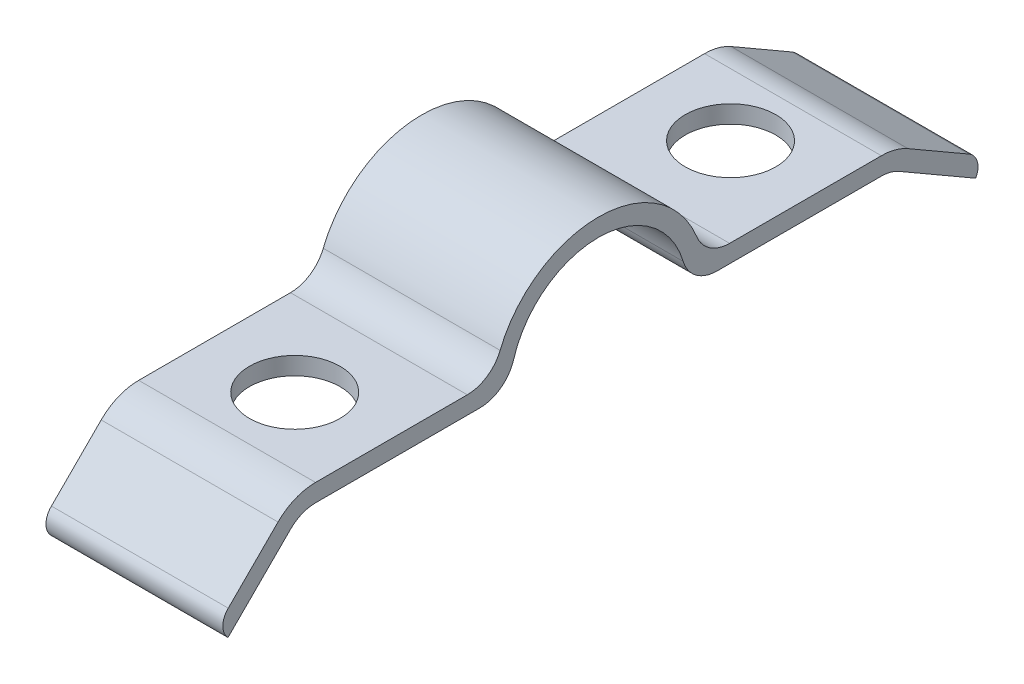
ISO-10303-21;
HEADER;
FILE_DESCRIPTION(('STEP AP214'),'2;1');
FILE_NAME('part.step','',(''),(''),'','','');
FILE_SCHEMA(('AUTOMOTIVE_DESIGN { 1 0 10303 214 1 1 1 1 }'));
ENDSEC;
DATA;
#1=APPLICATION_CONTEXT('core data for automotive mechanical design processes');
#2=APPLICATION_PROTOCOL_DEFINITION('international standard','automotive_design',2000,#1);
#3=PRODUCT_CONTEXT('',#1,'mechanical');
#4=PRODUCT('Part','Part','',(#3));
#5=PRODUCT_RELATED_PRODUCT_CATEGORY('part','',(#4));
#6=PRODUCT_DEFINITION_FORMATION('','',#4);
#7=PRODUCT_DEFINITION_CONTEXT('part definition',#1,'design');
#8=PRODUCT_DEFINITION('design','',#6,#7);
#9=PRODUCT_DEFINITION_SHAPE('','',#8);
#10=(LENGTH_UNIT() NAMED_UNIT(*) SI_UNIT(.MILLI.,.METRE.));
#11=(NAMED_UNIT(*) PLANE_ANGLE_UNIT() SI_UNIT($,.RADIAN.));
#12=(NAMED_UNIT(*) SI_UNIT($,.STERADIAN.) SOLID_ANGLE_UNIT());
#13=UNCERTAINTY_MEASURE_WITH_UNIT(LENGTH_MEASURE(1.E-05),#10,'distance_accuracy_value','');
#14=(GEOMETRIC_REPRESENTATION_CONTEXT(3) GLOBAL_UNCERTAINTY_ASSIGNED_CONTEXT((#13)) GLOBAL_UNIT_ASSIGNED_CONTEXT((#10,
#11,#12)) REPRESENTATION_CONTEXT('',''));
#15=CARTESIAN_POINT('',(0.,0.,0.));
#16=DIRECTION('',(0.,0.,1.));
#17=DIRECTION('',(1.,0.,0.));
#18=AXIS2_PLACEMENT_3D('',#15,#16,#17);
#19=CARTESIAN_POINT('',(3.175,1.27,-4.2597094971371));
#20=DIRECTION('',(-1.,0.,0.));
#21=DIRECTION('',(0.,0.,1.));
#22=AXIS2_PLACEMENT_3D('',#19,#20,#21);
#23=CYLINDRICAL_SURFACE('',#22,1.27);
#24=CARTESIAN_POINT('',(-3.175,1.27,-4.2597094971371));
#25=DIRECTION('',(1.,0.,0.));
#26=DIRECTION('',(0.,0.,1.));
#27=AXIS2_PLACEMENT_3D('',#24,#25,#26);
#28=CIRCLE('',#27,1.27);
#29=CARTESIAN_POINT('',(-3.175,0.907142857142857,-3.04264964081221));
#30=VERTEX_POINT('',#29);
#31=CARTESIAN_POINT('',(-3.175,0.,-4.2597094971371));
#32=VERTEX_POINT('',#31);
#33=EDGE_CURVE('E203',#30,#32,#28,.T.);
#34=ORIENTED_EDGE('',*,*,#33,.T.);
#35=DIRECTION('',(-1.,0.,0.));
#36=VECTOR('',#35,1.);
#37=CARTESIAN_POINT('',(3.175,0.,-4.2597094971371));
#38=LINE('',#37,#36);
#39=CARTESIAN_POINT('',(3.175,0.,-4.2597094971371));
#40=VERTEX_POINT('',#39);
#41=EDGE_CURVE('E11',#40,#32,#38,.T.);
#42=ORIENTED_EDGE('',*,*,#41,.F.);
#43=CARTESIAN_POINT('',(3.175,1.27,-4.2597094971371));
#44=DIRECTION('',(1.,0.,0.));
#45=DIRECTION('',(0.,0.,1.));
#46=AXIS2_PLACEMENT_3D('',#43,#44,#45);
#47=CIRCLE('',#46,1.27);
#48=CARTESIAN_POINT('',(3.175,0.907142857142857,-3.04264964081221));
#49=VERTEX_POINT('',#48);
#50=EDGE_CURVE('E243',#49,#40,#47,.T.);
#51=ORIENTED_EDGE('',*,*,#50,.F.);
#52=DIRECTION('',(-1.,0.,0.));
#53=VECTOR('',#52,1.);
#54=CARTESIAN_POINT('',(3.175,0.907142857142857,-3.04264964081221));
#55=LINE('',#54,#53);
#56=EDGE_CURVE('E199',#49,#30,#55,.T.);
#57=ORIENTED_EDGE('',*,*,#56,.T.);
#58=EDGE_LOOP('',(#34,#42,#51,#57));
#59=FACE_BOUND('',#58,.T.);
#60=ADVANCED_FACE('F34',(#59),#23,.T.);
#61=CARTESIAN_POINT('',(3.175,0.,-4.2597094971371));
#62=DIRECTION('',(0.,1.,0.));
#63=DIRECTION('',(0.,0.,1.));
#64=AXIS2_PLACEMENT_3D('',#61,#62,#63);
#65=PLANE('',#64);
#66=CARTESIAN_POINT('',(0.,0.,-7.91718));
#67=DIRECTION('',(0.,1.,0.));
#68=DIRECTION('',(0.,0.,1.));
#69=AXIS2_PLACEMENT_3D('',#66,#67,#68);
#70=CIRCLE('',#69,1.6256);
#71=CARTESIAN_POINT('',(0.,0.,-6.29158));
#72=VERTEX_POINT('',#71);
#73=EDGE_CURVE('E428',#72,#72,#70,.F.);
#74=ORIENTED_EDGE('',*,*,#73,.F.);
#75=EDGE_LOOP('',(#74));
#76=FACE_BOUND('',#75,.T.);
#77=DIRECTION('',(0.,0.,-1.));
#78=VECTOR('',#77,1.);
#79=CARTESIAN_POINT('',(-3.175,0.,-4.2597094971371));
#80=LINE('',#79,#78);
#81=CARTESIAN_POINT('',(-3.175,0.,-10.16));
#82=VERTEX_POINT('',#81);
#83=EDGE_CURVE('E206',#32,#82,#80,.T.);
#84=ORIENTED_EDGE('',*,*,#83,.T.);
#85=DIRECTION('',(-1.,0.,0.));
#86=VECTOR('',#85,1.);
#87=CARTESIAN_POINT('',(3.175,0.,-10.16));
#88=LINE('',#87,#86);
#89=CARTESIAN_POINT('',(3.175,0.,-10.16));
#90=VERTEX_POINT('',#89);
#91=EDGE_CURVE('E43',#90,#82,#88,.T.);
#92=ORIENTED_EDGE('',*,*,#91,.F.);
#93=DIRECTION('',(0.,0.,-1.));
#94=VECTOR('',#93,1.);
#95=CARTESIAN_POINT('',(3.175,0.,-4.2597094971371));
#96=LINE('',#95,#94);
#97=EDGE_CURVE('E130',#40,#90,#96,.T.);
#98=ORIENTED_EDGE('',*,*,#97,.F.);
#99=ORIENTED_EDGE('',*,*,#41,.T.);
#100=EDGE_LOOP('',(#84,#92,#98,#99));
#101=FACE_BOUND('',#100,.T.);
#102=ADVANCED_FACE('F360',(#76,#101),#65,.F.);
#103=CARTESIAN_POINT('',(3.175,-1.27,-10.16));
#104=DIRECTION('',(-1.,0.,0.));
#105=DIRECTION('',(0.,0.,1.));
#106=AXIS2_PLACEMENT_3D('',#103,#104,#105);
#107=CYLINDRICAL_SURFACE('',#106,1.27);
#108=CARTESIAN_POINT('',(-3.175,-1.27,-10.16));
#109=DIRECTION('',(-1.,0.,0.));
#110=DIRECTION('',(0.,0.,-1.));
#111=AXIS2_PLACEMENT_3D('',#108,#109,#110);
#112=CIRCLE('',#111,1.27);
#113=CARTESIAN_POINT('',(-3.175,-0.170147737193764,-10.795));
#114=VERTEX_POINT('',#113);
#115=EDGE_CURVE('E208',#82,#114,#112,.T.);
#116=ORIENTED_EDGE('',*,*,#115,.T.);
#117=DIRECTION('',(-1.,0.,0.));
#118=VECTOR('',#117,1.);
#119=CARTESIAN_POINT('',(3.175,-0.170147737193764,-10.795));
#120=LINE('',#119,#118);
#121=CARTESIAN_POINT('',(3.175,-0.170147737193764,-10.795));
#122=VERTEX_POINT('',#121);
#123=EDGE_CURVE('E286',#122,#114,#120,.T.);
#124=ORIENTED_EDGE('',*,*,#123,.F.);
#125=CARTESIAN_POINT('',(3.175,-1.27,-10.16));
#126=DIRECTION('',(-1.,0.,0.));
#127=DIRECTION('',(0.,0.,-1.));
#128=AXIS2_PLACEMENT_3D('',#125,#126,#127);
#129=CIRCLE('',#128,1.27);
#130=EDGE_CURVE('E295',#90,#122,#129,.T.);
#131=ORIENTED_EDGE('',*,*,#130,.F.);
#132=ORIENTED_EDGE('',*,*,#91,.T.);
#133=EDGE_LOOP('',(#116,#124,#131,#132));
#134=FACE_BOUND('',#133,.T.);
#135=ADVANCED_FACE('F293',(#134),#107,.F.);
#136=CARTESIAN_POINT('',(3.175,-1.44014773719377,-12.9947045256125));
#137=DIRECTION('',(0.,0.86602540378444,-0.499999999999997));
#138=DIRECTION('',(0.,0.499999999999997,0.86602540378444));
#139=AXIS2_PLACEMENT_3D('',#136,#137,#138);
#140=PLANE('',#139);
#141=DIRECTION('',(0.,-0.499999999999997,-0.86602540378444));
#142=VECTOR('',#141,1.);
#143=CARTESIAN_POINT('',(-3.175,-1.44014773719377,-12.9947045256125));
#144=LINE('',#143,#142);
#145=CARTESIAN_POINT('',(-3.175,-1.75764773719376,-13.5446306570156));
#146=VERTEX_POINT('',#145);
#147=EDGE_CURVE('E211',#114,#146,#144,.T.);
#148=ORIENTED_EDGE('',*,*,#147,.T.);
#149=DIRECTION('',(-1.,0.,0.));
#150=VECTOR('',#149,1.);
#151=CARTESIAN_POINT('',(3.175,-1.75764773719376,-13.5446306570156));
#152=LINE('',#151,#150);
#153=CARTESIAN_POINT('',(3.175,-1.75764773719376,-13.5446306570156));
#154=VERTEX_POINT('',#153);
#155=EDGE_CURVE('E283',#154,#146,#152,.T.);
#156=ORIENTED_EDGE('',*,*,#155,.F.);
#157=DIRECTION('',(0.,-0.500000000000001,-0.866025403784438));
#158=VECTOR('',#157,1.);
#159=CARTESIAN_POINT('',(3.175,-0.170147737193765,-10.795));
#160=LINE('',#159,#158);
#161=EDGE_CURVE('E312',#122,#154,#160,.T.);
#162=ORIENTED_EDGE('',*,*,#161,.F.);
#163=ORIENTED_EDGE('',*,*,#123,.T.);
#164=EDGE_LOOP('',(#148,#156,#162,#163));
#165=FACE_BOUND('',#164,.T.);
#166=ADVANCED_FACE('F303',(#165),#140,.F.);
#167=CARTESIAN_POINT('',(3.175,-1.44014773719377,-12.9947045256125));
#168=DIRECTION('',(-1.,0.,0.));
#169=DIRECTION('',(0.,0.,1.));
#170=AXIS2_PLACEMENT_3D('',#167,#168,#169);
#171=CYLINDRICAL_SURFACE('',#170,0.635000000000001);
#172=CARTESIAN_POINT('',(-3.175,-1.44014773719377,-12.9947045256125));
#173=DIRECTION('',(1.,0.,0.));
#174=DIRECTION('',(0.,0.,-1.));
#175=AXIS2_PLACEMENT_3D('',#172,#173,#174);
#176=CIRCLE('',#175,0.635000000000001);
#177=CARTESIAN_POINT('',(-3.175,-0.890221605790649,-13.3122045256125));
#178=VERTEX_POINT('',#177);
#179=EDGE_CURVE('E213',#146,#178,#176,.T.);
#180=ORIENTED_EDGE('',*,*,#179,.T.);
#181=DIRECTION('',(-1.,0.,0.));
#182=VECTOR('',#181,1.);
#183=CARTESIAN_POINT('',(3.175,-0.890221605790649,-13.3122045256125));
#184=LINE('',#183,#182);
#185=CARTESIAN_POINT('',(3.175,-0.890221605790649,-13.3122045256125));
#186=VERTEX_POINT('',#185);
#187=EDGE_CURVE('E280',#186,#178,#184,.T.);
#188=ORIENTED_EDGE('',*,*,#187,.F.);
#189=CARTESIAN_POINT('',(3.175,-1.44014773719377,-12.9947045256125));
#190=DIRECTION('',(1.,0.,0.));
#191=DIRECTION('',(0.,0.,-1.));
#192=AXIS2_PLACEMENT_3D('',#189,#190,#191);
#193=CIRCLE('',#192,0.635000000000001);
#194=EDGE_CURVE('E309',#154,#186,#193,.T.);
#195=ORIENTED_EDGE('',*,*,#194,.F.);
#196=ORIENTED_EDGE('',*,*,#155,.T.);
#197=EDGE_LOOP('',(#180,#188,#195,#196));
#198=FACE_BOUND('',#197,.T.);
#199=ADVANCED_FACE('F307',(#198),#171,.T.);
#200=CARTESIAN_POINT('',(3.175,0.379778394209357,-11.1125));
#201=DIRECTION('',(0.,-0.866025403784438,0.500000000000001));
#202=DIRECTION('',(0.,-0.500000000000001,-0.866025403784438));
#203=AXIS2_PLACEMENT_3D('',#200,#201,#202);
#204=PLANE('',#203);
#205=DIRECTION('',(0.,0.500000000000001,0.866025403784438));
#206=VECTOR('',#205,1.);
#207=CARTESIAN_POINT('',(-3.175,0.379778394209357,-11.1125));
#208=LINE('',#207,#206);
#209=CARTESIAN_POINT('',(-3.175,0.379778394209357,-11.1125));
#210=VERTEX_POINT('',#209);
#211=EDGE_CURVE('E215',#178,#210,#208,.T.);
#212=ORIENTED_EDGE('',*,*,#211,.T.);
#213=DIRECTION('',(-1.,0.,0.));
#214=VECTOR('',#213,1.);
#215=CARTESIAN_POINT('',(3.175,0.379778394209357,-11.1125));
#216=LINE('',#215,#214);
#217=CARTESIAN_POINT('',(3.175,0.379778394209357,-11.1125));
#218=VERTEX_POINT('',#217);
#219=EDGE_CURVE('E277',#218,#210,#216,.T.);
#220=ORIENTED_EDGE('',*,*,#219,.F.);
#221=DIRECTION('',(0.,0.500000000000001,0.866025403784438));
#222=VECTOR('',#221,1.);
#223=CARTESIAN_POINT('',(3.175,0.379778394209357,-11.1125));
#224=LINE('',#223,#222);
#225=EDGE_CURVE('E311',#186,#218,#224,.T.);
#226=ORIENTED_EDGE('',*,*,#225,.F.);
#227=ORIENTED_EDGE('',*,*,#187,.T.);
#228=EDGE_LOOP('',(#212,#220,#226,#227));
#229=FACE_BOUND('',#228,.T.);
#230=ADVANCED_FACE('F375',(#229),#204,.F.);
#231=CARTESIAN_POINT('',(3.175,-1.27,-10.16));
#232=DIRECTION('',(-1.,0.,0.));
#233=DIRECTION('',(0.,0.,1.));
#234=AXIS2_PLACEMENT_3D('',#231,#232,#233);
#235=CYLINDRICAL_SURFACE('',#234,1.905);
#236=CARTESIAN_POINT('',(-3.175,-1.27,-10.16));
#237=DIRECTION('',(1.,0.,0.));
#238=DIRECTION('',(0.,0.,-1.));
#239=AXIS2_PLACEMENT_3D('',#236,#237,#238);
#240=CIRCLE('',#239,1.905);
#241=CARTESIAN_POINT('',(-3.175,0.635000000000002,-10.16));
#242=VERTEX_POINT('',#241);
#243=EDGE_CURVE('E217',#210,#242,#240,.T.);
#244=ORIENTED_EDGE('',*,*,#243,.T.);
#245=DIRECTION('',(-1.,0.,0.));
#246=VECTOR('',#245,1.);
#247=CARTESIAN_POINT('',(3.175,0.635000000000002,-10.16));
#248=LINE('',#247,#246);
#249=CARTESIAN_POINT('',(3.175,0.635000000000002,-10.16));
#250=VERTEX_POINT('',#249);
#251=EDGE_CURVE('E274',#250,#242,#248,.T.);
#252=ORIENTED_EDGE('',*,*,#251,.F.);
#253=CARTESIAN_POINT('',(3.175,-1.27,-10.16));
#254=DIRECTION('',(1.,0.,0.));
#255=DIRECTION('',(0.,0.,-1.));
#256=AXIS2_PLACEMENT_3D('',#253,#254,#255);
#257=CIRCLE('',#256,1.905);
#258=EDGE_CURVE('E314',#218,#250,#257,.T.);
#259=ORIENTED_EDGE('',*,*,#258,.F.);
#260=ORIENTED_EDGE('',*,*,#219,.T.);
#261=EDGE_LOOP('',(#244,#252,#259,#260));
#262=FACE_BOUND('',#261,.T.);
#263=ADVANCED_FACE('F378',(#262),#235,.T.);
#264=CARTESIAN_POINT('',(3.175,0.635000000000001,-10.16));
#265=DIRECTION('',(0.,-1.,0.));
#266=DIRECTION('',(0.,0.,-1.));
#267=AXIS2_PLACEMENT_3D('',#264,#265,#266);
#268=PLANE('',#267);
#269=CARTESIAN_POINT('',(0.,0.635000000000001,-7.91718));
#270=DIRECTION('',(0.,-1.,0.));
#271=DIRECTION('',(0.,0.,-1.));
#272=AXIS2_PLACEMENT_3D('',#269,#270,#271);
#273=CIRCLE('',#272,1.6256);
#274=CARTESIAN_POINT('',(0.,0.635000000000001,-9.54278));
#275=VERTEX_POINT('',#274);
#276=EDGE_CURVE('E37',#275,#275,#273,.F.);
#277=ORIENTED_EDGE('',*,*,#276,.F.);
#278=EDGE_LOOP('',(#277));
#279=FACE_BOUND('',#278,.T.);
#280=DIRECTION('',(0.,0.,1.));
#281=VECTOR('',#280,1.);
#282=CARTESIAN_POINT('',(-3.175,0.635000000000001,-10.16));
#283=LINE('',#282,#281);
#284=CARTESIAN_POINT('',(-3.175,0.635,-4.70928603930574));
#285=VERTEX_POINT('',#284);
#286=EDGE_CURVE('E219',#242,#285,#283,.T.);
#287=ORIENTED_EDGE('',*,*,#286,.T.);
#288=DIRECTION('',(-1.,0.,0.));
#289=VECTOR('',#288,1.);
#290=CARTESIAN_POINT('',(3.175,0.635,-4.70928603930574));
#291=LINE('',#290,#289);
#292=CARTESIAN_POINT('',(3.175,0.635,-4.70928603930574));
#293=VERTEX_POINT('',#292);
#294=EDGE_CURVE('E271',#293,#285,#291,.T.);
#295=ORIENTED_EDGE('',*,*,#294,.F.);
#296=DIRECTION('',(0.,0.,1.));
#297=VECTOR('',#296,1.);
#298=CARTESIAN_POINT('',(3.175,0.635000000000001,-10.16));
#299=LINE('',#298,#297);
#300=EDGE_CURVE('E320',#250,#293,#299,.T.);
#301=ORIENTED_EDGE('',*,*,#300,.F.);
#302=ORIENTED_EDGE('',*,*,#251,.T.);
#303=EDGE_LOOP('',(#287,#295,#301,#302));
#304=FACE_BOUND('',#303,.T.);
#305=ADVANCED_FACE('F382',(#279,#304),#268,.F.);
#306=CARTESIAN_POINT('',(3.175,1.905,-4.70928603930574));
#307=DIRECTION('',(-1.,0.,0.));
#308=DIRECTION('',(0.,0.,1.));
#309=AXIS2_PLACEMENT_3D('',#306,#307,#308);
#310=CYLINDRICAL_SURFACE('',#309,1.27);
#311=CARTESIAN_POINT('',(-3.175,1.905,-4.70928603930574));
#312=DIRECTION('',(-1.,0.,0.));
#313=DIRECTION('',(0.,0.,1.));
#314=AXIS2_PLACEMENT_3D('',#311,#312,#313);
#315=CIRCLE('',#314,1.27);
#316=CARTESIAN_POINT('',(-3.175,1.42875,-3.53196452947931));
#317=VERTEX_POINT('',#316);
#318=EDGE_CURVE('E221',#285,#317,#315,.T.);
#319=ORIENTED_EDGE('',*,*,#318,.T.);
#320=DIRECTION('',(-1.,0.,0.));
#321=VECTOR('',#320,1.);
#322=CARTESIAN_POINT('',(3.175,1.42875,-3.53196452947931));
#323=LINE('',#322,#321);
#324=CARTESIAN_POINT('',(3.175,1.42875,-3.53196452947931));
#325=VERTEX_POINT('',#324);
#326=EDGE_CURVE('E268',#325,#317,#323,.T.);
#327=ORIENTED_EDGE('',*,*,#326,.F.);
#328=CARTESIAN_POINT('',(3.175,1.905,-4.70928603930574));
#329=DIRECTION('',(-1.,0.,0.));
#330=DIRECTION('',(0.,0.,1.));
#331=AXIS2_PLACEMENT_3D('',#328,#329,#330);
#332=CIRCLE('',#331,1.27);
#333=EDGE_CURVE('E322',#293,#325,#332,.T.);
#334=ORIENTED_EDGE('',*,*,#333,.F.);
#335=ORIENTED_EDGE('',*,*,#294,.T.);
#336=EDGE_LOOP('',(#319,#327,#334,#335));
#337=FACE_BOUND('',#336,.T.);
#338=ADVANCED_FACE('F386',(#337),#310,.F.);
#339=CARTESIAN_POINT('',(3.175,0.,0.));
#340=DIRECTION('',(-1.,0.,0.));
#341=DIRECTION('',(0.,0.,1.));
#342=AXIS2_PLACEMENT_3D('',#339,#340,#341);
#343=CYLINDRICAL_SURFACE('',#342,3.81);
#344=CARTESIAN_POINT('',(-3.175,0.,0.));
#345=DIRECTION('',(1.,0.,0.));
#346=DIRECTION('',(0.,0.,-1.));
#347=AXIS2_PLACEMENT_3D('',#344,#345,#346);
#348=CIRCLE('',#347,3.81);
#349=CARTESIAN_POINT('',(-3.175,1.42875,3.53196452947931));
#350=VERTEX_POINT('',#349);
#351=EDGE_CURVE('E223',#317,#350,#348,.T.);
#352=ORIENTED_EDGE('',*,*,#351,.T.);
#353=DIRECTION('',(-1.,0.,0.));
#354=VECTOR('',#353,1.);
#355=CARTESIAN_POINT('',(3.175,1.42875,3.53196452947931));
#356=LINE('',#355,#354);
#357=CARTESIAN_POINT('',(3.175,1.42875,3.53196452947931));
#358=VERTEX_POINT('',#357);
#359=EDGE_CURVE('E265',#358,#350,#356,.T.);
#360=ORIENTED_EDGE('',*,*,#359,.F.);
#361=CARTESIAN_POINT('',(3.175,0.,0.));
#362=DIRECTION('',(1.,0.,0.));
#363=DIRECTION('',(0.,0.,-1.));
#364=AXIS2_PLACEMENT_3D('',#361,#362,#363);
#365=CIRCLE('',#364,3.81);
#366=EDGE_CURVE('E324',#325,#358,#365,.T.);
#367=ORIENTED_EDGE('',*,*,#366,.F.);
#368=ORIENTED_EDGE('',*,*,#326,.T.);
#369=EDGE_LOOP('',(#352,#360,#367,#368));
#370=FACE_BOUND('',#369,.T.);
#371=ADVANCED_FACE('F390',(#370),#343,.T.);
#372=CARTESIAN_POINT('',(3.175,1.905,4.70928603930574));
#373=DIRECTION('',(-1.,0.,0.));
#374=DIRECTION('',(0.,0.,1.));
#375=AXIS2_PLACEMENT_3D('',#372,#373,#374);
#376=CYLINDRICAL_SURFACE('',#375,1.27);
#377=CARTESIAN_POINT('',(-3.175,1.905,4.70928603930574));
#378=DIRECTION('',(-1.,0.,0.));
#379=DIRECTION('',(0.,0.,-1.));
#380=AXIS2_PLACEMENT_3D('',#377,#378,#379);
#381=CIRCLE('',#380,1.27);
#382=CARTESIAN_POINT('',(-3.175,0.635,4.70928603930574));
#383=VERTEX_POINT('',#382);
#384=EDGE_CURVE('E225',#350,#383,#381,.T.);
#385=ORIENTED_EDGE('',*,*,#384,.T.);
#386=DIRECTION('',(-1.,0.,0.));
#387=VECTOR('',#386,1.);
#388=CARTESIAN_POINT('',(3.175,0.635,4.70928603930574));
#389=LINE('',#388,#387);
#390=CARTESIAN_POINT('',(3.175,0.635,4.70928603930574));
#391=VERTEX_POINT('',#390);
#392=EDGE_CURVE('E262',#391,#383,#389,.T.);
#393=ORIENTED_EDGE('',*,*,#392,.F.);
#394=CARTESIAN_POINT('',(3.175,1.905,4.70928603930574));
#395=DIRECTION('',(-1.,0.,0.));
#396=DIRECTION('',(0.,0.,-1.));
#397=AXIS2_PLACEMENT_3D('',#394,#395,#396);
#398=CIRCLE('',#397,1.27);
#399=EDGE_CURVE('E326',#358,#391,#398,.T.);
#400=ORIENTED_EDGE('',*,*,#399,.F.);
#401=ORIENTED_EDGE('',*,*,#359,.T.);
#402=EDGE_LOOP('',(#385,#393,#400,#401));
#403=FACE_BOUND('',#402,.T.);
#404=ADVANCED_FACE('F394',(#403),#376,.F.);
#405=CARTESIAN_POINT('',(3.175,0.634999999999999,10.16));
#406=DIRECTION('',(0.,-1.,0.));
#407=DIRECTION('',(0.,0.,-1.));
#408=AXIS2_PLACEMENT_3D('',#405,#406,#407);
#409=PLANE('',#408);
#410=CARTESIAN_POINT('',(0.,0.635,7.73176));
#411=DIRECTION('',(0.,-1.,0.));
#412=DIRECTION('',(0.,0.,-1.));
#413=AXIS2_PLACEMENT_3D('',#410,#411,#412);
#414=CIRCLE('',#413,1.6256);
#415=CARTESIAN_POINT('',(0.,0.635,6.10616));
#416=VERTEX_POINT('',#415);
#417=EDGE_CURVE('E427',#416,#416,#414,.F.);
#418=ORIENTED_EDGE('',*,*,#417,.F.);
#419=EDGE_LOOP('',(#418));
#420=FACE_BOUND('',#419,.T.);
#421=DIRECTION('',(0.,0.,1.));
#422=VECTOR('',#421,1.);
#423=CARTESIAN_POINT('',(-3.175,0.634999999999999,10.16));
#424=LINE('',#423,#422);
#425=CARTESIAN_POINT('',(-3.175,0.634999999999999,10.16));
#426=VERTEX_POINT('',#425);
#427=EDGE_CURVE('E227',#383,#426,#424,.T.);
#428=ORIENTED_EDGE('',*,*,#427,.T.);
#429=DIRECTION('',(-1.,0.,0.));
#430=VECTOR('',#429,1.);
#431=CARTESIAN_POINT('',(3.175,0.634999999999999,10.16));
#432=LINE('',#431,#430);
#433=CARTESIAN_POINT('',(3.175,0.634999999999999,10.16));
#434=VERTEX_POINT('',#433);
#435=EDGE_CURVE('E259',#434,#426,#432,.T.);
#436=ORIENTED_EDGE('',*,*,#435,.F.);
#437=DIRECTION('',(0.,0.,1.));
#438=VECTOR('',#437,1.);
#439=CARTESIAN_POINT('',(3.175,0.634999999999999,10.16));
#440=LINE('',#439,#438);
#441=EDGE_CURVE('E328',#391,#434,#440,.T.);
#442=ORIENTED_EDGE('',*,*,#441,.F.);
#443=ORIENTED_EDGE('',*,*,#392,.T.);
#444=EDGE_LOOP('',(#428,#436,#442,#443));
#445=FACE_BOUND('',#444,.T.);
#446=ADVANCED_FACE('F398',(#420,#445),#409,.F.);
#447=CARTESIAN_POINT('',(3.175,-1.27,10.16));
#448=DIRECTION('',(-1.,0.,0.));
#449=DIRECTION('',(0.,0.,1.));
#450=AXIS2_PLACEMENT_3D('',#447,#448,#449);
#451=CYLINDRICAL_SURFACE('',#450,1.905);
#452=CARTESIAN_POINT('',(-3.175,-1.27,10.16));
#453=DIRECTION('',(1.,0.,0.));
#454=DIRECTION('',(0.,0.,-1.));
#455=AXIS2_PLACEMENT_3D('',#452,#453,#454);
#456=CIRCLE('',#455,1.905);
#457=CARTESIAN_POINT('',(-3.175,0.0770384181603793,11.5070384181604));
#458=VERTEX_POINT('',#457);
#459=EDGE_CURVE('E229',#426,#458,#456,.T.);
#460=ORIENTED_EDGE('',*,*,#459,.T.);
#461=DIRECTION('',(-1.,0.,0.));
#462=VECTOR('',#461,1.);
#463=CARTESIAN_POINT('',(3.175,0.0770384181603793,11.5070384181604));
#464=LINE('',#463,#462);
#465=CARTESIAN_POINT('',(3.175,0.0770384181603793,11.5070384181604));
#466=VERTEX_POINT('',#465);
#467=EDGE_CURVE('E256',#466,#458,#464,.T.);
#468=ORIENTED_EDGE('',*,*,#467,.F.);
#469=CARTESIAN_POINT('',(3.175,-1.27,10.16));
#470=DIRECTION('',(1.,0.,0.));
#471=DIRECTION('',(0.,0.,-1.));
#472=AXIS2_PLACEMENT_3D('',#469,#470,#471);
#473=CIRCLE('',#472,1.905);
#474=EDGE_CURVE('E330',#434,#466,#473,.T.);
#475=ORIENTED_EDGE('',*,*,#474,.F.);
#476=ORIENTED_EDGE('',*,*,#435,.T.);
#477=EDGE_LOOP('',(#460,#468,#475,#476));
#478=FACE_BOUND('',#477,.T.);
#479=ADVANCED_FACE('F402',(#478),#451,.T.);
#480=CARTESIAN_POINT('',(3.175,0.0770384181603796,11.5070384181604));
#481=DIRECTION('',(0.,-0.707106781186551,-0.707106781186544));
#482=DIRECTION('',(0.,0.707106781186544,-0.707106781186551));
#483=AXIS2_PLACEMENT_3D('',#480,#481,#482);
#484=PLANE('',#483);
#485=DIRECTION('',(0.,-0.707106781186544,0.707106781186551));
#486=VECTOR('',#485,1.);
#487=CARTESIAN_POINT('',(-3.175,0.0770384181603796,11.5070384181604));
#488=LINE('',#487,#486);
#489=CARTESIAN_POINT('',(-3.175,-1.70885945730652,13.2929362936273));
#490=VERTEX_POINT('',#489);
#491=EDGE_CURVE('E231',#458,#490,#488,.T.);
#492=ORIENTED_EDGE('',*,*,#491,.T.);
#493=DIRECTION('',(-1.,0.,0.));
#494=VECTOR('',#493,1.);
#495=CARTESIAN_POINT('',(3.175,-1.70885945730652,13.2929362936273));
#496=LINE('',#495,#494);
#497=CARTESIAN_POINT('',(3.175,-1.70885945730652,13.2929362936273));
#498=VERTEX_POINT('',#497);
#499=EDGE_CURVE('E253',#498,#490,#496,.T.);
#500=ORIENTED_EDGE('',*,*,#499,.F.);
#501=DIRECTION('',(0.,-0.707106781186544,0.707106781186551));
#502=VECTOR('',#501,1.);
#503=CARTESIAN_POINT('',(3.175,0.0770384181603796,11.5070384181604));
#504=LINE('',#503,#502);
#505=EDGE_CURVE('E332',#466,#498,#504,.T.);
#506=ORIENTED_EDGE('',*,*,#505,.F.);
#507=ORIENTED_EDGE('',*,*,#467,.T.);
#508=EDGE_LOOP('',(#492,#500,#506,#507));
#509=FACE_BOUND('',#508,.T.);
#510=ADVANCED_FACE('F406',(#509),#484,.F.);
#511=CARTESIAN_POINT('',(3.175,-2.1680256121069,12.8540768363208));
#512=DIRECTION('',(-1.,0.,0.));
#513=DIRECTION('',(0.,0.,1.));
#514=AXIS2_PLACEMENT_3D('',#511,#512,#513);
#515=CYLINDRICAL_SURFACE('',#514,0.635162326481627);
#516=CARTESIAN_POINT('',(-3.175,-2.1680256121069,12.8540768363208));
#517=DIRECTION('',(1.,0.,0.));
#518=DIRECTION('',(0.,0.,-1.));
#519=AXIS2_PLACEMENT_3D('',#516,#517,#518);
#520=CIRCLE('',#519,0.635162326481627);
#521=CARTESIAN_POINT('',(-3.175,-2.61715320031628,13.3032044245301));
#522=VERTEX_POINT('',#521);
#523=EDGE_CURVE('E233',#490,#522,#520,.T.);
#524=ORIENTED_EDGE('',*,*,#523,.T.);
#525=DIRECTION('',(-1.,0.,0.));
#526=VECTOR('',#525,1.);
#527=CARTESIAN_POINT('',(3.175,-2.61715320031628,13.3032044245301));
#528=LINE('',#527,#526);
#529=CARTESIAN_POINT('',(3.175,-2.61715320031628,13.3032044245301));
#530=VERTEX_POINT('',#529);
#531=EDGE_CURVE('E250',#530,#522,#528,.T.);
#532=ORIENTED_EDGE('',*,*,#531,.F.);
#533=CARTESIAN_POINT('',(3.175,-2.1680256121069,12.8540768363208));
#534=DIRECTION('',(1.,0.,0.));
#535=DIRECTION('',(0.,0.,-1.));
#536=AXIS2_PLACEMENT_3D('',#533,#534,#535);
#537=CIRCLE('',#536,0.635162326481627);
#538=EDGE_CURVE('E334',#498,#530,#537,.T.);
#539=ORIENTED_EDGE('',*,*,#538,.F.);
#540=ORIENTED_EDGE('',*,*,#499,.T.);
#541=EDGE_LOOP('',(#524,#532,#539,#540));
#542=FACE_BOUND('',#541,.T.);
#543=ADVANCED_FACE('F410',(#542),#515,.T.);
#544=CARTESIAN_POINT('',(3.175,-0.371974387893081,11.0580256121069));
#545=DIRECTION('',(0.,0.707106781186551,0.707106781186544));
#546=DIRECTION('',(0.,-0.707106781186544,0.707106781186551));
#547=AXIS2_PLACEMENT_3D('',#544,#545,#546);
#548=PLANE('',#547);
#549=DIRECTION('',(0.,0.707106781186544,-0.707106781186551));
#550=VECTOR('',#549,1.);
#551=CARTESIAN_POINT('',(-3.175,-0.371974387893081,11.0580256121069));
#552=LINE('',#551,#550);
#553=CARTESIAN_POINT('',(-3.175,-0.371974387893081,11.0580256121069));
#554=VERTEX_POINT('',#553);
#555=EDGE_CURVE('E236',#522,#554,#552,.T.);
#556=ORIENTED_EDGE('',*,*,#555,.T.);
#557=DIRECTION('',(-1.,0.,0.));
#558=VECTOR('',#557,1.);
#559=CARTESIAN_POINT('',(3.175,-0.371974387893081,11.0580256121069));
#560=LINE('',#559,#558);
#561=CARTESIAN_POINT('',(3.175,-0.371974387893081,11.0580256121069));
#562=VERTEX_POINT('',#561);
#563=EDGE_CURVE('E247',#562,#554,#560,.T.);
#564=ORIENTED_EDGE('',*,*,#563,.F.);
#565=DIRECTION('',(0.,0.707106781186544,-0.707106781186551));
#566=VECTOR('',#565,1.);
#567=CARTESIAN_POINT('',(3.175,-2.1680256121069,12.8540768363208));
#568=LINE('',#567,#566);
#569=EDGE_CURVE('E336',#530,#562,#568,.T.);
#570=ORIENTED_EDGE('',*,*,#569,.F.);
#571=ORIENTED_EDGE('',*,*,#531,.T.);
#572=EDGE_LOOP('',(#556,#564,#570,#571));
#573=FACE_BOUND('',#572,.T.);
#574=ADVANCED_FACE('F342',(#573),#548,.F.);
#575=CARTESIAN_POINT('',(3.175,-1.27,10.16));
#576=DIRECTION('',(-1.,0.,0.));
#577=DIRECTION('',(0.,0.,1.));
#578=AXIS2_PLACEMENT_3D('',#575,#576,#577);
#579=CYLINDRICAL_SURFACE('',#578,1.27);
#580=CARTESIAN_POINT('',(-3.175,-1.27,10.16));
#581=DIRECTION('',(-1.,0.,0.));
#582=DIRECTION('',(0.,0.,-1.));
#583=AXIS2_PLACEMENT_3D('',#580,#581,#582);
#584=CIRCLE('',#583,1.27);
#585=CARTESIAN_POINT('',(-3.175,0.,10.16));
#586=VERTEX_POINT('',#585);
#587=EDGE_CURVE('E238',#554,#586,#584,.T.);
#588=ORIENTED_EDGE('',*,*,#587,.T.);
#589=DIRECTION('',(-1.,0.,0.));
#590=VECTOR('',#589,1.);
#591=CARTESIAN_POINT('',(3.175,0.,10.16));
#592=LINE('',#591,#590);
#593=CARTESIAN_POINT('',(3.175,0.,10.16));
#594=VERTEX_POINT('',#593);
#595=EDGE_CURVE('E194',#594,#586,#592,.T.);
#596=ORIENTED_EDGE('',*,*,#595,.F.);
#597=CARTESIAN_POINT('',(3.175,-1.27,10.16));
#598=DIRECTION('',(-1.,0.,0.));
#599=DIRECTION('',(0.,0.,-1.));
#600=AXIS2_PLACEMENT_3D('',#597,#598,#599);
#601=CIRCLE('',#600,1.27);
#602=EDGE_CURVE('E185',#562,#594,#601,.T.);
#603=ORIENTED_EDGE('',*,*,#602,.F.);
#604=ORIENTED_EDGE('',*,*,#563,.T.);
#605=EDGE_LOOP('',(#588,#596,#603,#604));
#606=FACE_BOUND('',#605,.T.);
#607=ADVANCED_FACE('F345',(#606),#579,.F.);
#608=CARTESIAN_POINT('',(3.175,0.,10.16));
#609=DIRECTION('',(0.,1.,0.));
#610=DIRECTION('',(0.,0.,1.));
#611=AXIS2_PLACEMENT_3D('',#608,#609,#610);
#612=PLANE('',#611);
#613=CARTESIAN_POINT('',(0.,0.,7.73176));
#614=DIRECTION('',(0.,1.,0.));
#615=DIRECTION('',(0.,0.,1.));
#616=AXIS2_PLACEMENT_3D('',#613,#614,#615);
#617=CIRCLE('',#616,1.6256);
#618=CARTESIAN_POINT('',(0.,0.,9.35736));
#619=VERTEX_POINT('',#618);
#620=EDGE_CURVE('E425',#619,#619,#617,.F.);
#621=ORIENTED_EDGE('',*,*,#620,.F.);
#622=EDGE_LOOP('',(#621));
#623=FACE_BOUND('',#622,.T.);
#624=DIRECTION('',(0.,0.,-1.));
#625=VECTOR('',#624,1.);
#626=CARTESIAN_POINT('',(-3.175,0.,10.16));
#627=LINE('',#626,#625);
#628=CARTESIAN_POINT('',(-3.175,0.,4.2597094971371));
#629=VERTEX_POINT('',#628);
#630=EDGE_CURVE('E193',#586,#629,#627,.T.);
#631=ORIENTED_EDGE('',*,*,#630,.T.);
#632=DIRECTION('',(-1.,0.,0.));
#633=VECTOR('',#632,1.);
#634=CARTESIAN_POINT('',(3.175,0.,4.2597094971371));
#635=LINE('',#634,#633);
#636=CARTESIAN_POINT('',(3.175,0.,4.2597094971371));
#637=VERTEX_POINT('',#636);
#638=EDGE_CURVE('E190',#637,#629,#635,.T.);
#639=ORIENTED_EDGE('',*,*,#638,.F.);
#640=DIRECTION('',(0.,0.,-1.));
#641=VECTOR('',#640,1.);
#642=CARTESIAN_POINT('',(3.175,0.,10.16));
#643=LINE('',#642,#641);
#644=EDGE_CURVE('E179',#594,#637,#643,.T.);
#645=ORIENTED_EDGE('',*,*,#644,.F.);
#646=ORIENTED_EDGE('',*,*,#595,.T.);
#647=EDGE_LOOP('',(#631,#639,#645,#646));
#648=FACE_BOUND('',#647,.T.);
#649=ADVANCED_FACE('F191',(#623,#648),#612,.F.);
#650=CARTESIAN_POINT('',(3.175,1.27,4.2597094971371));
#651=DIRECTION('',(-1.,0.,0.));
#652=DIRECTION('',(0.,0.,1.));
#653=AXIS2_PLACEMENT_3D('',#650,#651,#652);
#654=CYLINDRICAL_SURFACE('',#653,1.27);
#655=CARTESIAN_POINT('',(-3.175,1.27,4.2597094971371));
#656=DIRECTION('',(1.,0.,0.));
#657=DIRECTION('',(0.,0.,-1.));
#658=AXIS2_PLACEMENT_3D('',#655,#656,#657);
#659=CIRCLE('',#658,1.27);
#660=CARTESIAN_POINT('',(-3.175,0.907142857142856,3.04264964081221));
#661=VERTEX_POINT('',#660);
#662=EDGE_CURVE('E116',#629,#661,#659,.T.);
#663=ORIENTED_EDGE('',*,*,#662,.T.);
#664=DIRECTION('',(-1.,0.,0.));
#665=VECTOR('',#664,1.);
#666=CARTESIAN_POINT('',(3.175,0.907142857142856,3.04264964081221));
#667=LINE('',#666,#665);
#668=CARTESIAN_POINT('',(3.175,0.907142857142856,3.04264964081221));
#669=VERTEX_POINT('',#668);
#670=EDGE_CURVE('E195',#669,#661,#667,.T.);
#671=ORIENTED_EDGE('',*,*,#670,.F.);
#672=CARTESIAN_POINT('',(3.175,1.27,4.2597094971371));
#673=DIRECTION('',(1.,0.,0.));
#674=DIRECTION('',(0.,0.,-1.));
#675=AXIS2_PLACEMENT_3D('',#672,#673,#674);
#676=CIRCLE('',#675,1.27);
#677=EDGE_CURVE('E183',#637,#669,#676,.T.);
#678=ORIENTED_EDGE('',*,*,#677,.F.);
#679=ORIENTED_EDGE('',*,*,#638,.T.);
#680=EDGE_LOOP('',(#663,#671,#678,#679));
#681=FACE_BOUND('',#680,.T.);
#682=ADVANCED_FACE('F197',(#681),#654,.T.);
#683=CARTESIAN_POINT('',(3.175,0.,0.));
#684=DIRECTION('',(-1.,0.,0.));
#685=DIRECTION('',(0.,0.,1.));
#686=AXIS2_PLACEMENT_3D('',#683,#684,#685);
#687=CYLINDRICAL_SURFACE('',#686,3.175);
#688=CARTESIAN_POINT('',(-3.175,0.,0.));
#689=DIRECTION('',(-1.,0.,0.));
#690=DIRECTION('',(0.,0.,-1.));
#691=AXIS2_PLACEMENT_3D('',#688,#689,#690);
#692=CIRCLE('',#691,3.175);
#693=EDGE_CURVE('E122',#661,#30,#692,.T.);
#694=ORIENTED_EDGE('',*,*,#693,.T.);
#695=ORIENTED_EDGE('',*,*,#56,.F.);
#696=CARTESIAN_POINT('',(3.175,0.,0.));
#697=DIRECTION('',(-1.,0.,0.));
#698=DIRECTION('',(0.,0.,-1.));
#699=AXIS2_PLACEMENT_3D('',#696,#697,#698);
#700=CIRCLE('',#699,3.175);
#701=EDGE_CURVE('E51',#669,#49,#700,.T.);
#702=ORIENTED_EDGE('',*,*,#701,.F.);
#703=ORIENTED_EDGE('',*,*,#670,.T.);
#704=EDGE_LOOP('',(#694,#695,#702,#703));
#705=FACE_BOUND('',#704,.T.);
#706=ADVANCED_FACE('F349',(#705),#687,.F.);
#707=CARTESIAN_POINT('',(3.175,1.27,-4.2597094971371));
#708=DIRECTION('',(-1.,0.,0.));
#709=DIRECTION('',(0.,0.,1.));
#710=AXIS2_PLACEMENT_3D('',#707,#708,#709);
#711=PLANE('',#710);
#712=ORIENTED_EDGE('',*,*,#50,.T.);
#713=ORIENTED_EDGE('',*,*,#97,.T.);
#714=ORIENTED_EDGE('',*,*,#130,.T.);
#715=ORIENTED_EDGE('',*,*,#161,.T.);
#716=ORIENTED_EDGE('',*,*,#194,.T.);
#717=ORIENTED_EDGE('',*,*,#225,.T.);
#718=ORIENTED_EDGE('',*,*,#258,.T.);
#719=ORIENTED_EDGE('',*,*,#300,.T.);
#720=ORIENTED_EDGE('',*,*,#333,.T.);
#721=ORIENTED_EDGE('',*,*,#366,.T.);
#722=ORIENTED_EDGE('',*,*,#399,.T.);
#723=ORIENTED_EDGE('',*,*,#441,.T.);
#724=ORIENTED_EDGE('',*,*,#474,.T.);
#725=ORIENTED_EDGE('',*,*,#505,.T.);
#726=ORIENTED_EDGE('',*,*,#538,.T.);
#727=ORIENTED_EDGE('',*,*,#569,.T.);
#728=ORIENTED_EDGE('',*,*,#602,.T.);
#729=ORIENTED_EDGE('',*,*,#644,.T.);
#730=ORIENTED_EDGE('',*,*,#677,.T.);
#731=ORIENTED_EDGE('',*,*,#701,.T.);
#732=EDGE_LOOP('',(#712,#713,#714,#715,#716,#717,#718,#719,#720,#721,#722,#723,#724,#725,#726,
#727,#728,#729,#730,#731));
#733=FACE_BOUND('',#732,.T.);
#734=ADVANCED_FACE('F181',(#733),#711,.F.);
#735=CARTESIAN_POINT('',(-3.175,1.27,-4.2597094971371));
#736=DIRECTION('',(-1.,0.,0.));
#737=DIRECTION('',(0.,0.,1.));
#738=AXIS2_PLACEMENT_3D('',#735,#736,#737);
#739=PLANE('',#738);
#740=ORIENTED_EDGE('',*,*,#33,.F.);
#741=ORIENTED_EDGE('',*,*,#693,.F.);
#742=ORIENTED_EDGE('',*,*,#662,.F.);
#743=ORIENTED_EDGE('',*,*,#630,.F.);
#744=ORIENTED_EDGE('',*,*,#587,.F.);
#745=ORIENTED_EDGE('',*,*,#555,.F.);
#746=ORIENTED_EDGE('',*,*,#523,.F.);
#747=ORIENTED_EDGE('',*,*,#491,.F.);
#748=ORIENTED_EDGE('',*,*,#459,.F.);
#749=ORIENTED_EDGE('',*,*,#427,.F.);
#750=ORIENTED_EDGE('',*,*,#384,.F.);
#751=ORIENTED_EDGE('',*,*,#351,.F.);
#752=ORIENTED_EDGE('',*,*,#318,.F.);
#753=ORIENTED_EDGE('',*,*,#286,.F.);
#754=ORIENTED_EDGE('',*,*,#243,.F.);
#755=ORIENTED_EDGE('',*,*,#211,.F.);
#756=ORIENTED_EDGE('',*,*,#179,.F.);
#757=ORIENTED_EDGE('',*,*,#147,.F.);
#758=ORIENTED_EDGE('',*,*,#115,.F.);
#759=ORIENTED_EDGE('',*,*,#83,.F.);
#760=EDGE_LOOP('',(#740,#741,#742,#743,#744,#745,#746,#747,#748,#749,#750,#751,#752,#753,#754,
#755,#756,#757,#758,#759));
#761=FACE_BOUND('',#760,.T.);
#762=ADVANCED_FACE('F298',(#761),#739,.T.);
#763=CARTESIAN_POINT('',(0.,3.81,7.73176));
#764=DIRECTION('',(0.,-1.,0.));
#765=DIRECTION('',(0.,0.,-1.));
#766=AXIS2_PLACEMENT_3D('',#763,#764,#765);
#767=CYLINDRICAL_SURFACE('',#766,1.6256);
#768=ORIENTED_EDGE('',*,*,#620,.T.);
#769=EDGE_LOOP('',(#768));
#770=FACE_BOUND('',#769,.T.);
#771=ORIENTED_EDGE('',*,*,#417,.T.);
#772=EDGE_LOOP('',(#771));
#773=FACE_BOUND('',#772,.T.);
#774=ADVANCED_FACE('F440',(#770,#773),#767,.F.);
#775=CARTESIAN_POINT('',(0.,3.81,-7.91718));
#776=DIRECTION('',(0.,-1.,0.));
#777=DIRECTION('',(0.,0.,-1.));
#778=AXIS2_PLACEMENT_3D('',#775,#776,#777);
#779=CYLINDRICAL_SURFACE('',#778,1.6256);
#780=ORIENTED_EDGE('',*,*,#73,.T.);
#781=EDGE_LOOP('',(#780));
#782=FACE_BOUND('',#781,.T.);
#783=ORIENTED_EDGE('',*,*,#276,.T.);
#784=EDGE_LOOP('',(#783));
#785=FACE_BOUND('',#784,.T.);
#786=ADVANCED_FACE('F437',(#782,#785),#779,.F.);
#787=CLOSED_SHELL('',(#60,#102,#135,#166,#199,#230,#263,#305,#338,#371,#404,#446,#479,#510,#543,
#574,#607,#649,#682,#706,#734,#762,#774,#786));
#788=MANIFOLD_SOLID_BREP('B2',#787);
#789=ADVANCED_BREP_SHAPE_REPRESENTATION('',(#18,#788),#14);
#790=SHAPE_DEFINITION_REPRESENTATION(#9,#789);
ENDSEC;
END-ISO-10303-21;
